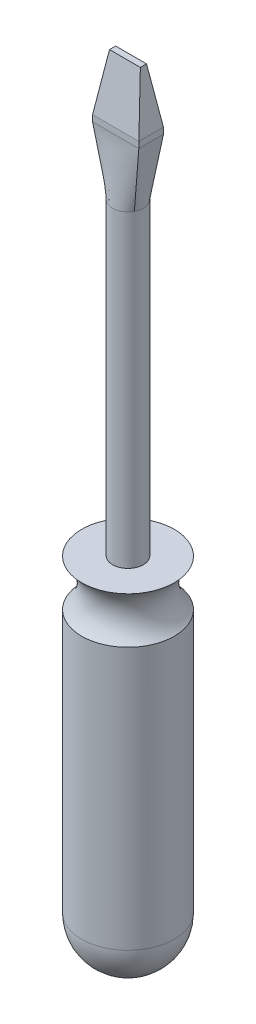
ISO-10303-21;
HEADER;
FILE_DESCRIPTION(('STEP AP214'),'2;1');
FILE_NAME('part.step','',(''),(''),'','','');
FILE_SCHEMA(('AUTOMOTIVE_DESIGN { 1 0 10303 214 1 1 1 1 }'));
ENDSEC;
DATA;
#1=APPLICATION_CONTEXT('core data for automotive mechanical design processes');
#2=APPLICATION_PROTOCOL_DEFINITION('international standard','automotive_design',2000,#1);
#3=PRODUCT_CONTEXT('',#1,'mechanical');
#4=PRODUCT('Part','Part','',(#3));
#5=PRODUCT_RELATED_PRODUCT_CATEGORY('part','',(#4));
#6=PRODUCT_DEFINITION_FORMATION('','',#4);
#7=PRODUCT_DEFINITION_CONTEXT('part definition',#1,'design');
#8=PRODUCT_DEFINITION('design','',#6,#7);
#9=PRODUCT_DEFINITION_SHAPE('','',#8);
#10=(LENGTH_UNIT() NAMED_UNIT(*) SI_UNIT(.MILLI.,.METRE.));
#11=(NAMED_UNIT(*) PLANE_ANGLE_UNIT() SI_UNIT($,.RADIAN.));
#12=(NAMED_UNIT(*) SI_UNIT($,.STERADIAN.) SOLID_ANGLE_UNIT());
#13=UNCERTAINTY_MEASURE_WITH_UNIT(LENGTH_MEASURE(1.E-05),#10,'distance_accuracy_value','');
#14=(GEOMETRIC_REPRESENTATION_CONTEXT(3) GLOBAL_UNCERTAINTY_ASSIGNED_CONTEXT((#13)) GLOBAL_UNIT_ASSIGNED_CONTEXT((#10,
#11,#12)) REPRESENTATION_CONTEXT('',''));
#15=CARTESIAN_POINT('',(0.,0.,0.));
#16=DIRECTION('',(0.,0.,1.));
#17=DIRECTION('',(1.,0.,0.));
#18=AXIS2_PLACEMENT_3D('',#15,#16,#17);
#19=CARTESIAN_POINT('',(0.,8.33,0.));
#20=DIRECTION('',(0.,-1.,0.));
#21=DIRECTION('',(0.,0.,-1.));
#22=AXIS2_PLACEMENT_3D('',#19,#20,#21);
#23=CYLINDRICAL_SURFACE('',#22,0.25);
#24=CARTESIAN_POINT('',(0.220584767675422,8.32999999937951,0.117653560377832));
#25=CARTESIAN_POINT('',(0.223895503250794,8.33000760524374,0.111447662226681));
#26=CARTESIAN_POINT('',(0.226942525622998,8.330106840505,0.105102891851778));
#27=CARTESIAN_POINT('',(0.232491387490373,8.33035427569991,0.0921798481124795));
#28=CARTESIAN_POINT('',(0.234993215228491,8.33050247668932,0.0856015697160707));
#29=CARTESIAN_POINT('',(0.239430949186873,8.33071340242395,0.0722645516503332));
#30=CARTESIAN_POINT('',(0.241367574651988,8.33077623617844,0.0655060533840937));
#31=CARTESIAN_POINT('',(0.244664857885471,8.33076876888091,0.0518501331683878));
#32=CARTESIAN_POINT('',(0.246025528224331,8.33069847073475,0.0449527142543722));
#33=CARTESIAN_POINT('',(0.248162373998193,8.33046613436582,0.0310625301912614));
#34=CARTESIAN_POINT('',(0.248937931759474,8.33030399951081,0.0240696721953106));
#35=CARTESIAN_POINT('',(0.249897096671828,8.33006059794133,0.0100421207075355));
#36=CARTESIAN_POINT('',(0.250080782759349,8.32997932044412,0.0030074329198293));
#37=CARTESIAN_POINT('',(0.249854529071589,8.33004594723594,-0.0110500691070349));
#38=CARTESIAN_POINT('',(0.249444710494667,8.33019380473423,-0.0180728854772538));
#39=CARTESIAN_POINT('',(0.248035943141497,8.33048086415504,-0.0320569386292218));
#40=CARTESIAN_POINT('',(0.247036974397994,8.33062006578403,-0.0390181733157511));
#41=CARTESIAN_POINT('',(0.243409065531116,8.33082838683894,-0.0584216292134271));
#42=CARTESIAN_POINT('',(0.240115307959746,8.33075015870858,-0.0707508476074166));
#43=CARTESIAN_POINT('',(0.233804582622328,8.33044046915203,-0.0887475720229695));
#44=CARTESIAN_POINT('',(0.231470415901914,8.33030500919291,-0.0946678406394103));
#45=CARTESIAN_POINT('',(0.226357545092206,8.33008527072871,-0.106313646433992));
#46=CARTESIAN_POINT('',(0.223578865252806,8.33000098943283,-0.11203919421425));
#47=CARTESIAN_POINT('',(0.220584037163021,8.32999999909056,-0.117654929981124));
#48=B_SPLINE_CURVE_WITH_KNOTS('',3,(#24,#25,#26,#27,#28,#29,#30,#31,#32,#33,#34,#35,#36,#37,#38,
#39,#40,#41,#42,#43,#44,#45,#46,#47),.UNSPECIFIED.,.F.,.F.,(4,2,2,2,2,2,2,2,2,2,2,4),(0.,
0.0210928949861277,0.0421862447928407,0.063252634156513,0.0843185637126489,0.105406700506582,
0.126492024711936,0.147573043734018,0.168654777267132,0.206759216014801,0.225839793234812,
0.24491932989102),.UNSPECIFIED.);
#49=CARTESIAN_POINT('',(0.22089985520379,8.33,0.117821618988406));
#50=VERTEX_POINT('',#49);
#51=CARTESIAN_POINT('',(0.220873348394953,8.33,-0.117809242565207));
#52=VERTEX_POINT('',#51);
#53=EDGE_CURVE('E13',#50,#52,#48,.T.);
#54=ORIENTED_EDGE('',*,*,#53,.F.);
#55=CARTESIAN_POINT('',(0.,8.33,0.));
#56=DIRECTION('',(0.,1.,0.));
#57=DIRECTION('',(0.,0.,1.));
#58=AXIS2_PLACEMENT_3D('',#55,#56,#57);
#59=CIRCLE('',#58,0.25);
#60=CARTESIAN_POINT('',(-0.220873348394953,8.33,0.117809242565207));
#61=VERTEX_POINT('',#60);
#62=EDGE_CURVE('E110',#61,#50,#59,.T.);
#63=ORIENTED_EDGE('',*,*,#62,.F.);
#64=CARTESIAN_POINT('',(-0.220584767675422,8.32999999937951,-0.117653560377832));
#65=CARTESIAN_POINT('',(-0.223895503250794,8.33000760524374,-0.111447662226681));
#66=CARTESIAN_POINT('',(-0.226942525622998,8.330106840505,-0.105102891851778));
#67=CARTESIAN_POINT('',(-0.232491387490373,8.33035427569991,-0.0921798481124798));
#68=CARTESIAN_POINT('',(-0.234993215228491,8.33050247668932,-0.085601569716071));
#69=CARTESIAN_POINT('',(-0.239430949186873,8.33071340242395,-0.0722645516503335));
#70=CARTESIAN_POINT('',(-0.241367574651988,8.33077623617843,-0.065506053384094));
#71=CARTESIAN_POINT('',(-0.244664857885471,8.33076876888091,-0.0518501331683881));
#72=CARTESIAN_POINT('',(-0.24602552822433,8.33069847073475,-0.0449527142543724));
#73=CARTESIAN_POINT('',(-0.248162373998193,8.33046613436582,-0.0310625301912616));
#74=CARTESIAN_POINT('',(-0.248937931759474,8.33030399951081,-0.0240696721953109));
#75=CARTESIAN_POINT('',(-0.249897096671828,8.33006059794133,-0.0100421207075359));
#76=CARTESIAN_POINT('',(-0.250080782759349,8.32997932044412,-0.00300743291982959));
#77=CARTESIAN_POINT('',(-0.249854529071589,8.33004594723594,0.0110500691070346));
#78=CARTESIAN_POINT('',(-0.249444710494667,8.33019380473423,0.0180728854772535));
#79=CARTESIAN_POINT('',(-0.248035943141497,8.33048086415504,0.0320569386292215));
#80=CARTESIAN_POINT('',(-0.247036974397994,8.33062006578403,0.0390181733157507));
#81=CARTESIAN_POINT('',(-0.243409065531116,8.33082838683893,0.0584216292134269));
#82=CARTESIAN_POINT('',(-0.240115307959746,8.33075015870857,0.0707508476074164));
#83=CARTESIAN_POINT('',(-0.233804582622328,8.33044046915203,0.0887475720229693));
#84=CARTESIAN_POINT('',(-0.231470415901914,8.33030500919291,0.0946678406394101));
#85=CARTESIAN_POINT('',(-0.226357545092206,8.33008527072871,0.106313646433991));
#86=CARTESIAN_POINT('',(-0.223578865252806,8.33000098943284,0.11203919421425));
#87=CARTESIAN_POINT('',(-0.220584037163021,8.32999999909056,0.117654929981124));
#88=B_SPLINE_CURVE_WITH_KNOTS('',3,(#64,#65,#66,#67,#68,#69,#70,#71,#72,#73,#74,#75,#76,#77,#78,
#79,#80,#81,#82,#83,#84,#85,#86,#87),.UNSPECIFIED.,.F.,.F.,(4,2,2,2,2,2,2,2,2,2,2,4),(0.,
0.0210928949861277,0.0421862447928407,0.063252634156513,0.0843185637126489,0.105406700506582,
0.126492024711936,0.147573043734018,0.168654777267132,0.206759216014802,0.225839793234812,
0.24491932989102),.UNSPECIFIED.);
#89=CARTESIAN_POINT('',(-0.220899855203791,8.33,-0.117821618988406));
#90=VERTEX_POINT('',#89);
#91=EDGE_CURVE('E158',#90,#61,#88,.T.);
#92=ORIENTED_EDGE('',*,*,#91,.F.);
#93=EDGE_CURVE('E155',#52,#90,#59,.T.);
#94=ORIENTED_EDGE('',*,*,#93,.F.);
#95=EDGE_LOOP('',(#54,#63,#92,#94));
#96=FACE_BOUND('',#95,.T.);
#97=CARTESIAN_POINT('',(0.,3.33,0.));
#98=DIRECTION('',(0.,1.,0.));
#99=DIRECTION('',(0.,0.,1.));
#100=AXIS2_PLACEMENT_3D('',#97,#98,#99);
#101=CIRCLE('',#100,0.25);
#102=CARTESIAN_POINT('',(0.,3.33,0.25));
#103=VERTEX_POINT('',#102);
#104=EDGE_CURVE('E101',#103,#103,#101,.T.);
#105=ORIENTED_EDGE('',*,*,#104,.T.);
#106=EDGE_LOOP('',(#105));
#107=FACE_BOUND('',#106,.T.);
#108=ADVANCED_FACE('F91',(#96,#107),#23,.T.);
#109=CARTESIAN_POINT('',(0.,3.33,0.));
#110=DIRECTION('',(0.,1.,0.));
#111=DIRECTION('',(0.,0.,1.));
#112=AXIS2_PLACEMENT_3D('',#109,#110,#111);
#113=PLANE('',#112);
#114=ORIENTED_EDGE('',*,*,#104,.F.);
#115=EDGE_LOOP('',(#114));
#116=FACE_BOUND('',#115,.T.);
#117=ADVANCED_FACE('F209',(#116),#113,.F.);
#118=CARTESIAN_POINT('',(-0.220588235294118,8.33,0.117647058823529));
#119=CARTESIAN_POINT('',(-0.375,9.33,0.2));
#120=CARTESIAN_POINT('',(-0.203287197231834,8.33,0.150086505190311));
#121=CARTESIAN_POINT('',(-0.312499999999999,9.33,0.2));
#122=CARTESIAN_POINT('',(-0.175911118592711,8.33,0.183465196532278));
#123=CARTESIAN_POINT('',(-0.249999999999999,9.33,0.2));
#124=CARTESIAN_POINT('',(-0.0993182392054541,8.33,0.233965996128272));
#125=CARTESIAN_POINT('',(-0.124999999999998,9.33,0.2));
#126=CARTESIAN_POINT('',(-0.05,8.33,0.25));
#127=CARTESIAN_POINT('',(-0.0624999999999981,9.33,0.2));
#128=CARTESIAN_POINT('',(0.0499999999999999,8.33,0.25));
#129=CARTESIAN_POINT('',(0.0625000000000019,9.33,0.2));
#130=CARTESIAN_POINT('',(0.099318239205454,8.33,0.233965996128272));
#131=CARTESIAN_POINT('',(0.125000000000002,9.33,0.2));
#132=CARTESIAN_POINT('',(0.175911118592711,8.33,0.183465196532278));
#133=CARTESIAN_POINT('',(0.250000000000001,9.33,0.2));
#134=CARTESIAN_POINT('',(0.203287197231834,8.33,0.150086505190311));
#135=CARTESIAN_POINT('',(0.312500000000001,9.33,0.2));
#136=CARTESIAN_POINT('',(0.220588235294118,8.33,0.117647058823529));
#137=CARTESIAN_POINT('',(0.375,9.33,0.2));
#138=B_SPLINE_SURFACE_WITH_KNOTS('',3,1,((#118,#119),(#120,#121),(#122,#123),(#124,#125),(#126,
#127),(#128,#129),(#130,#131),(#132,#133),(#134,#135),(#136,#137)),.UNSPECIFIED.,.F.,.F.,.F.,(4,
2,2,2,4),(2,2),(0.,0.25,0.5,0.75,1.),(0.,1.),.UNSPECIFIED.);
#139=DIRECTION('',(0.152100292722572,0.985030467155704,0.0811201561187051));
#140=VECTOR('',#139,1.);
#141=CARTESIAN_POINT('',(0.297794117647059,8.83,0.158823529411765));
#142=LINE('',#141,#140);
#143=CARTESIAN_POINT('',(0.375,9.33,0.199637890792641));
#144=VERTEX_POINT('',#143);
#145=EDGE_CURVE('E138',#50,#144,#142,.T.);
#146=DIRECTION('',(1.,0.,0.));
#147=VECTOR('',#146,1.);
#148=CARTESIAN_POINT('',(-0.375,9.33,0.2));
#149=LINE('',#148,#147);
#150=CARTESIAN_POINT('',(-0.375,9.33,0.199637890792641));
#151=VERTEX_POINT('',#150);
#152=EDGE_CURVE('E298',#151,#144,#149,.T.);
#153=DIRECTION('',(0.152100292722572,-0.985030467155704,-0.0811201561187051));
#154=VECTOR('',#153,1.);
#155=CARTESIAN_POINT('',(-0.297794117647059,8.83,0.158823529411765));
#156=LINE('',#155,#154);
#157=EDGE_CURVE('E164',#151,#61,#156,.T.);
#158=ORIENTED_EDGE('',*,*,#62,.T.);
#159=ORIENTED_EDGE('',*,*,#145,.T.);
#160=ORIENTED_EDGE('',*,*,#152,.F.);
#161=ORIENTED_EDGE('',*,*,#157,.T.);
#162=EDGE_LOOP('',(#158,#159,#160,#161));
#163=FACE_BOUND('',#162,.T.);
#164=ADVANCED_FACE('F217',(#163),#138,.T.);
#165=CARTESIAN_POINT('',(0.219480968858131,8.33,0.119723183391003));
#166=CARTESIAN_POINT('',(0.375,9.33,0.204));
#167=CARTESIAN_POINT('',(0.219850057670127,8.33,0.119031141868512));
#168=CARTESIAN_POINT('',(0.375,9.33,0.202666666666667));
#169=CARTESIAN_POINT('',(0.220219146482122,8.33,0.118339100346021));
#170=CARTESIAN_POINT('',(0.375,9.33,0.201333333333333));
#171=CARTESIAN_POINT('',(0.220588235294118,8.33,0.117647058823529));
#172=CARTESIAN_POINT('',(0.375,9.33,0.2));
#173=CARTESIAN_POINT('',(0.239042675893887,8.33,0.0830449826989619));
#174=CARTESIAN_POINT('',(0.375,9.33,0.133333333333333));
#175=CARTESIAN_POINT('',(0.25,8.33,0.0416666666666667));
#176=CARTESIAN_POINT('',(0.375,9.33,0.0666666666666667));
#177=CARTESIAN_POINT('',(0.25,8.33,-0.0416666666666667));
#178=CARTESIAN_POINT('',(0.375,9.33,-0.0666666666666666));
#179=CARTESIAN_POINT('',(0.239042675893887,8.33,-0.083044982698962));
#180=CARTESIAN_POINT('',(0.375,9.33,-0.133333333333333));
#181=CARTESIAN_POINT('',(0.220588235294118,8.33,-0.117647058823529));
#182=CARTESIAN_POINT('',(0.375,9.33,-0.2));
#183=CARTESIAN_POINT('',(0.220219146482122,8.33,-0.118339100346021));
#184=CARTESIAN_POINT('',(0.375,9.33,-0.201333333333333));
#185=CARTESIAN_POINT('',(0.219850057670127,8.33,-0.119031141868512));
#186=CARTESIAN_POINT('',(0.375,9.33,-0.202666666666667));
#187=CARTESIAN_POINT('',(0.219480968858131,8.33,-0.119723183391004));
#188=CARTESIAN_POINT('',(0.375,9.33,-0.204));
#189=B_SPLINE_SURFACE_WITH_KNOTS('',3,1,((#165,#166),(#167,#168),(#169,#170),(#171,#172),(#173,
#174),(#175,#176),(#177,#178),(#179,#180),(#181,#182),(#183,#184),(#185,#186),(#187,#188)),
.UNSPECIFIED.,.F.,.F.,.F.,(4,3,2,3,4),(2,2),(-0.01,0.,0.5,1.,1.01),(0.,1.),.UNSPECIFIED.);
#190=DIRECTION('',(0.152100292722572,0.985030467155704,-0.0811201561187051));
#191=VECTOR('',#190,1.);
#192=CARTESIAN_POINT('',(0.297794117647059,8.83,-0.158823529411765));
#193=LINE('',#192,#191);
#194=CARTESIAN_POINT('',(0.375,9.33,-0.199637890792641));
#195=VERTEX_POINT('',#194);
#196=EDGE_CURVE('E169',#52,#195,#193,.T.);
#197=DIRECTION('',(0.,0.,-1.));
#198=VECTOR('',#197,1.);
#199=CARTESIAN_POINT('',(0.375,9.33,-0.2));
#200=LINE('',#199,#198);
#201=EDGE_CURVE('E177',#144,#195,#200,.T.);
#202=ORIENTED_EDGE('',*,*,#53,.T.);
#203=ORIENTED_EDGE('',*,*,#196,.T.);
#204=ORIENTED_EDGE('',*,*,#201,.F.);
#205=ORIENTED_EDGE('',*,*,#145,.F.);
#206=EDGE_LOOP('',(#202,#203,#204,#205));
#207=FACE_BOUND('',#206,.T.);
#208=ADVANCED_FACE('F168',(#207),#189,.T.);
#209=CARTESIAN_POINT('',(-0.219480968858131,8.33,-0.119723183391004));
#210=CARTESIAN_POINT('',(-0.375,9.33,-0.204));
#211=CARTESIAN_POINT('',(-0.219850057670127,8.33,-0.119031141868512));
#212=CARTESIAN_POINT('',(-0.375,9.33,-0.202666666666667));
#213=CARTESIAN_POINT('',(-0.220219146482122,8.33,-0.118339100346021));
#214=CARTESIAN_POINT('',(-0.375,9.33,-0.201333333333333));
#215=CARTESIAN_POINT('',(-0.220588235294118,8.33,-0.117647058823529));
#216=CARTESIAN_POINT('',(-0.375,9.33,-0.2));
#217=CARTESIAN_POINT('',(-0.239042675893887,8.33,-0.083044982698962));
#218=CARTESIAN_POINT('',(-0.375,9.33,-0.133333333333333));
#219=CARTESIAN_POINT('',(-0.25,8.33,-0.0416666666666667));
#220=CARTESIAN_POINT('',(-0.375,9.33,-0.0666666666666667));
#221=CARTESIAN_POINT('',(-0.25,8.33,0.0416666666666666));
#222=CARTESIAN_POINT('',(-0.375,9.33,0.0666666666666666));
#223=CARTESIAN_POINT('',(-0.239042675893887,8.33,0.0830449826989619));
#224=CARTESIAN_POINT('',(-0.375,9.33,0.133333333333333));
#225=CARTESIAN_POINT('',(-0.220588235294118,8.33,0.117647058823529));
#226=CARTESIAN_POINT('',(-0.375,9.33,0.2));
#227=CARTESIAN_POINT('',(-0.220219146482122,8.33,0.118339100346021));
#228=CARTESIAN_POINT('',(-0.375,9.33,0.201333333333333));
#229=CARTESIAN_POINT('',(-0.219850057670127,8.33,0.119031141868512));
#230=CARTESIAN_POINT('',(-0.375,9.33,0.202666666666667));
#231=CARTESIAN_POINT('',(-0.219480968858131,8.33,0.119723183391003));
#232=CARTESIAN_POINT('',(-0.375,9.33,0.204));
#233=B_SPLINE_SURFACE_WITH_KNOTS('',3,1,((#209,#210),(#211,#212),(#213,#214),(#215,#216),(#217,
#218),(#219,#220),(#221,#222),(#223,#224),(#225,#226),(#227,#228),(#229,#230),(#231,#232)),
.UNSPECIFIED.,.F.,.F.,.F.,(4,3,2,3,4),(2,2),(-0.01,0.,0.5,1.,1.01),(0.,1.),.UNSPECIFIED.);
#234=DIRECTION('',(0.,0.,1.));
#235=VECTOR('',#234,1.);
#236=CARTESIAN_POINT('',(-0.375,9.33,-0.2));
#237=LINE('',#236,#235);
#238=CARTESIAN_POINT('',(-0.375,9.33,-0.199637890792641));
#239=VERTEX_POINT('',#238);
#240=EDGE_CURVE('E227',#239,#151,#237,.T.);
#241=DIRECTION('',(-0.152100292722572,0.985030467155704,-0.0811201561187051));
#242=VECTOR('',#241,1.);
#243=CARTESIAN_POINT('',(-0.297794117647059,8.83,-0.158823529411765));
#244=LINE('',#243,#242);
#245=EDGE_CURVE('E175',#90,#239,#244,.T.);
#246=ORIENTED_EDGE('',*,*,#91,.T.);
#247=ORIENTED_EDGE('',*,*,#157,.F.);
#248=ORIENTED_EDGE('',*,*,#240,.F.);
#249=ORIENTED_EDGE('',*,*,#245,.F.);
#250=EDGE_LOOP('',(#246,#247,#248,#249));
#251=FACE_BOUND('',#250,.T.);
#252=ADVANCED_FACE('F204',(#251),#233,.T.);
#253=CARTESIAN_POINT('',(0.220588235294118,8.33,-0.117647058823529));
#254=CARTESIAN_POINT('',(0.375,9.33,-0.2));
#255=CARTESIAN_POINT('',(0.203287197231834,8.33,-0.150086505190311));
#256=CARTESIAN_POINT('',(0.312499999999999,9.33,-0.2));
#257=CARTESIAN_POINT('',(0.175911118592711,8.33,-0.183465196532278));
#258=CARTESIAN_POINT('',(0.249999999999999,9.33,-0.2));
#259=CARTESIAN_POINT('',(0.0993182392054541,8.33,-0.233965996128272));
#260=CARTESIAN_POINT('',(0.124999999999998,9.33,-0.2));
#261=CARTESIAN_POINT('',(0.05,8.33,-0.25));
#262=CARTESIAN_POINT('',(0.0624999999999982,9.33,-0.2));
#263=CARTESIAN_POINT('',(-0.0499999999999999,8.33,-0.25));
#264=CARTESIAN_POINT('',(-0.0625000000000018,9.33,-0.2));
#265=CARTESIAN_POINT('',(-0.099318239205454,8.33,-0.233965996128272));
#266=CARTESIAN_POINT('',(-0.125000000000002,9.33,-0.2));
#267=CARTESIAN_POINT('',(-0.175911118592711,8.33,-0.183465196532278));
#268=CARTESIAN_POINT('',(-0.250000000000001,9.33,-0.2));
#269=CARTESIAN_POINT('',(-0.203287197231834,8.33,-0.150086505190312));
#270=CARTESIAN_POINT('',(-0.312500000000001,9.33,-0.2));
#271=CARTESIAN_POINT('',(-0.220588235294118,8.33,-0.117647058823529));
#272=CARTESIAN_POINT('',(-0.375,9.33,-0.2));
#273=B_SPLINE_SURFACE_WITH_KNOTS('',3,1,((#253,#254),(#255,#256),(#257,#258),(#259,#260),(#261,
#262),(#263,#264),(#265,#266),(#267,#268),(#269,#270),(#271,#272)),.UNSPECIFIED.,.F.,.F.,.F.,(4,
2,2,2,4),(2,2),(0.,0.25,0.5,0.75,1.),(0.,1.),.UNSPECIFIED.);
#274=DIRECTION('',(-1.,0.,0.));
#275=VECTOR('',#274,1.);
#276=CARTESIAN_POINT('',(-0.375,9.33,-0.2));
#277=LINE('',#276,#275);
#278=EDGE_CURVE('E173',#195,#239,#277,.T.);
#279=ORIENTED_EDGE('',*,*,#93,.T.);
#280=ORIENTED_EDGE('',*,*,#245,.T.);
#281=ORIENTED_EDGE('',*,*,#278,.F.);
#282=ORIENTED_EDGE('',*,*,#196,.F.);
#283=EDGE_LOOP('',(#279,#280,#281,#282));
#284=FACE_BOUND('',#283,.T.);
#285=ADVANCED_FACE('F171',(#284),#273,.T.);
#286=CARTESIAN_POINT('',(0.375,9.43,-0.199275781585282));
#287=DIRECTION('',(-1.,0.,0.));
#288=DIRECTION('',(0.,0.,1.));
#289=AXIS2_PLACEMENT_3D('',#286,#287,#288);
#290=PLANE('',#289);
#291=ORIENTED_EDGE('',*,*,#201,.T.);
#292=DIRECTION('',(0.,-1.,0.));
#293=VECTOR('',#292,1.);
#294=CARTESIAN_POINT('',(0.375,9.43,-0.199275781585282));
#295=LINE('',#294,#293);
#296=CARTESIAN_POINT('',(0.375,9.43,-0.199275781585282));
#297=VERTEX_POINT('',#296);
#298=EDGE_CURVE('E242',#297,#195,#295,.T.);
#299=ORIENTED_EDGE('',*,*,#298,.F.);
#300=DIRECTION('',(0.,0.,1.));
#301=VECTOR('',#300,1.);
#302=CARTESIAN_POINT('',(0.375,9.43,0.));
#303=LINE('',#302,#301);
#304=CARTESIAN_POINT('',(0.375,9.43,0.199275781585282));
#305=VERTEX_POINT('',#304);
#306=EDGE_CURVE('E312',#305,#297,#303,.F.);
#307=ORIENTED_EDGE('',*,*,#306,.F.);
#308=DIRECTION('',(0.,-1.,0.));
#309=VECTOR('',#308,1.);
#310=CARTESIAN_POINT('',(0.375,9.43,0.199275781585282));
#311=LINE('',#310,#309);
#312=EDGE_CURVE('E248',#305,#144,#311,.T.);
#313=ORIENTED_EDGE('',*,*,#312,.T.);
#314=EDGE_LOOP('',(#291,#299,#307,#313));
#315=FACE_BOUND('',#314,.T.);
#316=ADVANCED_FACE('F203',(#315),#290,.F.);
#317=CARTESIAN_POINT('',(-0.375,9.43,-0.199275781585282));
#318=DIRECTION('',(0.,0.,1.));
#319=DIRECTION('',(1.,0.,0.));
#320=AXIS2_PLACEMENT_3D('',#317,#318,#319);
#321=PLANE('',#320);
#322=ORIENTED_EDGE('',*,*,#278,.T.);
#323=DIRECTION('',(0.,-1.,0.));
#324=VECTOR('',#323,1.);
#325=CARTESIAN_POINT('',(-0.375,9.43,-0.199275781585282));
#326=LINE('',#325,#324);
#327=CARTESIAN_POINT('',(-0.375,9.43,-0.199275781585282));
#328=VERTEX_POINT('',#327);
#329=EDGE_CURVE('E257',#328,#239,#326,.T.);
#330=ORIENTED_EDGE('',*,*,#329,.F.);
#331=DIRECTION('',(1.,0.,0.));
#332=VECTOR('',#331,1.);
#333=CARTESIAN_POINT('',(0.,9.43000000000001,-0.199275781585282));
#334=LINE('',#333,#332);
#335=EDGE_CURVE('E95',#297,#328,#334,.F.);
#336=ORIENTED_EDGE('',*,*,#335,.F.);
#337=ORIENTED_EDGE('',*,*,#298,.T.);
#338=EDGE_LOOP('',(#322,#330,#336,#337));
#339=FACE_BOUND('',#338,.T.);
#340=ADVANCED_FACE('F282',(#339),#321,.F.);
#341=CARTESIAN_POINT('',(-0.375,9.43,-0.199275781585282));
#342=DIRECTION('',(1.,0.,0.));
#343=DIRECTION('',(0.,0.,-1.));
#344=AXIS2_PLACEMENT_3D('',#341,#342,#343);
#345=PLANE('',#344);
#346=ORIENTED_EDGE('',*,*,#240,.T.);
#347=DIRECTION('',(0.,-1.,0.));
#348=VECTOR('',#347,1.);
#349=CARTESIAN_POINT('',(-0.375,9.43,0.199275781585282));
#350=LINE('',#349,#348);
#351=CARTESIAN_POINT('',(-0.375,9.43,0.199275781585282));
#352=VERTEX_POINT('',#351);
#353=EDGE_CURVE('E251',#352,#151,#350,.T.);
#354=ORIENTED_EDGE('',*,*,#353,.F.);
#355=DIRECTION('',(0.,0.,1.));
#356=VECTOR('',#355,1.);
#357=CARTESIAN_POINT('',(-0.375,9.43,0.));
#358=LINE('',#357,#356);
#359=EDGE_CURVE('E317',#328,#352,#358,.T.);
#360=ORIENTED_EDGE('',*,*,#359,.F.);
#361=ORIENTED_EDGE('',*,*,#329,.T.);
#362=EDGE_LOOP('',(#346,#354,#360,#361));
#363=FACE_BOUND('',#362,.T.);
#364=ADVANCED_FACE('F275',(#363),#345,.F.);
#365=CARTESIAN_POINT('',(-0.375,9.43,0.199275781585282));
#366=DIRECTION('',(0.,0.,-1.));
#367=DIRECTION('',(-1.,0.,0.));
#368=AXIS2_PLACEMENT_3D('',#365,#366,#367);
#369=PLANE('',#368);
#370=ORIENTED_EDGE('',*,*,#152,.T.);
#371=ORIENTED_EDGE('',*,*,#312,.F.);
#372=DIRECTION('',(1.,0.,0.));
#373=VECTOR('',#372,1.);
#374=CARTESIAN_POINT('',(0.,9.43000000000001,0.199275781585282));
#375=LINE('',#374,#373);
#376=EDGE_CURVE('E252',#352,#305,#375,.T.);
#377=ORIENTED_EDGE('',*,*,#376,.F.);
#378=ORIENTED_EDGE('',*,*,#353,.T.);
#379=EDGE_LOOP('',(#370,#371,#377,#378));
#380=FACE_BOUND('',#379,.T.);
#381=ADVANCED_FACE('F264',(#380),#369,.F.);
#382=CARTESIAN_POINT('',(0.,10.33,0.));
#383=DIRECTION('',(0.,1.,0.));
#384=DIRECTION('',(0.,0.,1.));
#385=AXIS2_PLACEMENT_3D('',#382,#383,#384);
#386=PLANE('',#385);
#387=DIRECTION('',(0.,0.,-1.));
#388=VECTOR('',#387,1.);
#389=CARTESIAN_POINT('',(0.25,10.33,-0.05));
#390=LINE('',#389,#388);
#391=CARTESIAN_POINT('',(0.25,10.33,0.05));
#392=VERTEX_POINT('',#391);
#393=CARTESIAN_POINT('',(0.25,10.33,-0.05));
#394=VERTEX_POINT('',#393);
#395=EDGE_CURVE('E339',#392,#394,#390,.T.);
#396=ORIENTED_EDGE('',*,*,#395,.T.);
#397=DIRECTION('',(-1.,0.,0.));
#398=VECTOR('',#397,1.);
#399=CARTESIAN_POINT('',(-0.25,10.33,-0.05));
#400=LINE('',#399,#398);
#401=CARTESIAN_POINT('',(-0.25,10.33,-0.05));
#402=VERTEX_POINT('',#401);
#403=EDGE_CURVE('E315',#394,#402,#400,.T.);
#404=ORIENTED_EDGE('',*,*,#403,.T.);
#405=DIRECTION('',(0.,0.,1.));
#406=VECTOR('',#405,1.);
#407=CARTESIAN_POINT('',(-0.25,10.33,-0.05));
#408=LINE('',#407,#406);
#409=CARTESIAN_POINT('',(-0.25,10.33,0.05));
#410=VERTEX_POINT('',#409);
#411=EDGE_CURVE('E334',#402,#410,#408,.T.);
#412=ORIENTED_EDGE('',*,*,#411,.T.);
#413=DIRECTION('',(1.,0.,0.));
#414=VECTOR('',#413,1.);
#415=CARTESIAN_POINT('',(-0.25,10.33,0.05));
#416=LINE('',#415,#414);
#417=EDGE_CURVE('E381',#410,#392,#416,.T.);
#418=ORIENTED_EDGE('',*,*,#417,.T.);
#419=EDGE_LOOP('',(#396,#404,#412,#418));
#420=FACE_BOUND('',#419,.T.);
#421=ADVANCED_FACE('F274',(#420),#386,.T.);
#422=CARTESIAN_POINT('',(1.65283875851628,0.229560938682816,0.));
#423=DIRECTION('',(-0.990492273177752,-0.137568371274688,0.));
#424=DIRECTION('',(0.137568371274688,-0.990492273177752,0.));
#425=AXIS2_PLACEMENT_3D('',#422,#423,#424);
#426=PLANE('',#425);
#427=DIRECTION('',(-0.135748669059126,0.977390417225709,0.162111909383703));
#428=VECTOR('',#427,1.);
#429=CARTESIAN_POINT('',(0.375,9.43,-0.199275781585282));
#430=LINE('',#429,#428);
#431=EDGE_CURVE('E330',#297,#394,#430,.T.);
#432=ORIENTED_EDGE('',*,*,#431,.T.);
#433=ORIENTED_EDGE('',*,*,#395,.F.);
#434=DIRECTION('',(-0.135748669059126,0.977390417225709,-0.162111909383703));
#435=VECTOR('',#434,1.);
#436=CARTESIAN_POINT('',(0.375,9.43,0.199275781585282));
#437=LINE('',#436,#435);
#438=EDGE_CURVE('E337',#305,#392,#437,.T.);
#439=ORIENTED_EDGE('',*,*,#438,.F.);
#440=ORIENTED_EDGE('',*,*,#306,.T.);
#441=EDGE_LOOP('',(#432,#433,#439,#440));
#442=FACE_BOUND('',#441,.T.);
#443=ADVANCED_FACE('F400',(#442),#426,.F.);
#444=CARTESIAN_POINT('',(0.,0.284642845758419,1.7161428227808));
#445=DIRECTION('',(0.,-0.163626550251267,-0.986522352535851));
#446=DIRECTION('',(0.,0.986522352535851,-0.163626550251267));
#447=AXIS2_PLACEMENT_3D('',#444,#445,#446);
#448=PLANE('',#447);
#449=ORIENTED_EDGE('',*,*,#438,.T.);
#450=ORIENTED_EDGE('',*,*,#417,.F.);
#451=DIRECTION('',(0.135748669059126,0.977390417225709,-0.162111909383703));
#452=VECTOR('',#451,1.);
#453=CARTESIAN_POINT('',(-0.375,9.43,0.199275781585282));
#454=LINE('',#453,#452);
#455=EDGE_CURVE('E336',#352,#410,#454,.T.);
#456=ORIENTED_EDGE('',*,*,#455,.F.);
#457=ORIENTED_EDGE('',*,*,#376,.T.);
#458=EDGE_LOOP('',(#449,#450,#456,#457));
#459=FACE_BOUND('',#458,.T.);
#460=ADVANCED_FACE('F364',(#459),#448,.F.);
#461=CARTESIAN_POINT('',(0.,0.284642845758419,-1.7161428227808));
#462=DIRECTION('',(0.,-0.163626550251267,0.986522352535851));
#463=DIRECTION('',(0.,-0.986522352535851,-0.163626550251267));
#464=AXIS2_PLACEMENT_3D('',#461,#462,#463);
#465=PLANE('',#464);
#466=DIRECTION('',(0.135748669059126,0.977390417225709,0.162111909383703));
#467=VECTOR('',#466,1.);
#468=CARTESIAN_POINT('',(-0.375,9.43,-0.199275781585282));
#469=LINE('',#468,#467);
#470=EDGE_CURVE('E329',#328,#402,#469,.T.);
#471=ORIENTED_EDGE('',*,*,#470,.T.);
#472=ORIENTED_EDGE('',*,*,#403,.F.);
#473=ORIENTED_EDGE('',*,*,#431,.F.);
#474=ORIENTED_EDGE('',*,*,#335,.T.);
#475=EDGE_LOOP('',(#471,#472,#473,#474));
#476=FACE_BOUND('',#475,.T.);
#477=ADVANCED_FACE('F327',(#476),#465,.F.);
#478=CARTESIAN_POINT('',(-1.65283875851628,0.229560938682816,0.));
#479=DIRECTION('',(0.990492273177752,-0.137568371274688,0.));
#480=DIRECTION('',(0.137568371274688,0.990492273177752,0.));
#481=AXIS2_PLACEMENT_3D('',#478,#479,#480);
#482=PLANE('',#481);
#483=ORIENTED_EDGE('',*,*,#455,.T.);
#484=ORIENTED_EDGE('',*,*,#411,.F.);
#485=ORIENTED_EDGE('',*,*,#470,.F.);
#486=ORIENTED_EDGE('',*,*,#359,.T.);
#487=EDGE_LOOP('',(#483,#484,#485,#486));
#488=FACE_BOUND('',#487,.T.);
#489=ADVANCED_FACE('F332',(#488),#482,.F.);
#490=CLOSED_SHELL('',(#108,#117,#164,#208,#252,#285,#316,#340,#364,#381,#421,#443,#460,#477,#489));
#491=MANIFOLD_SOLID_BREP('B2',#490);
#492=CARTESIAN_POINT('',(0.,2.57703162179985,0.));
#493=DIRECTION('',(0.,-1.,0.));
#494=DIRECTION('',(0.,0.,-1.));
#495=AXIS2_PLACEMENT_3D('',#492,#493,#494);
#496=CYLINDRICAL_SURFACE('',#495,0.75);
#497=CARTESIAN_POINT('',(0.,2.57703162179985,0.));
#498=DIRECTION('',(0.,1.,0.));
#499=DIRECTION('',(0.,0.,1.));
#500=AXIS2_PLACEMENT_3D('',#497,#498,#499);
#501=CIRCLE('',#500,0.75);
#502=CARTESIAN_POINT('',(0.,2.57703162179985,0.75));
#503=VERTEX_POINT('',#502);
#504=EDGE_CURVE('E90',#503,#503,#501,.T.);
#505=ORIENTED_EDGE('',*,*,#504,.F.);
#506=EDGE_LOOP('',(#505));
#507=FACE_BOUND('',#506,.T.);
#508=CARTESIAN_POINT('',(0.,-1.67296837820015,0.));
#509=DIRECTION('',(0.,1.,0.));
#510=DIRECTION('',(0.,0.,1.));
#511=AXIS2_PLACEMENT_3D('',#508,#509,#510);
#512=CIRCLE('',#511,0.75);
#513=CARTESIAN_POINT('',(0.,-1.67296837820015,0.75));
#514=VERTEX_POINT('',#513);
#515=EDGE_CURVE('E673',#514,#514,#512,.T.);
#516=ORIENTED_EDGE('',*,*,#515,.T.);
#517=EDGE_LOOP('',(#516));
#518=FACE_BOUND('',#517,.T.);
#519=ADVANCED_FACE('F669',(#507,#518),#496,.T.);
#520=CARTESIAN_POINT('',(0.,-1.67296837820015,0.));
#521=DIRECTION('',(0.,-1.,0.));
#522=DIRECTION('',(0.,0.,1.));
#523=AXIS2_PLACEMENT_3D('',#520,#521,#522);
#524=SPHERICAL_SURFACE('',#523,0.75);
#525=ORIENTED_EDGE('',*,*,#515,.F.);
#526=EDGE_LOOP('',(#525));
#527=FACE_BOUND('',#526,.T.);
#528=ADVANCED_FACE('F671',(#527),#524,.T.);
#529=CARTESIAN_POINT('',(0.,2.95203162179985,0.));
#530=DIRECTION('',(0.,-1.,0.));
#531=DIRECTION('',(1.,0.,0.));
#532=AXIS2_PLACEMENT_3D('',#529,#530,#531);
#533=TOROIDAL_SURFACE('',#532,1.08071891388307,0.5);
#534=CARTESIAN_POINT('',(0.,3.32703162179985,0.));
#535=DIRECTION('',(0.,-1.,0.));
#536=DIRECTION('',(1.,0.,0.));
#537=AXIS2_PLACEMENT_3D('',#534,#535,#536);
#538=CIRCLE('',#537,0.75);
#539=CARTESIAN_POINT('',(0.75,3.32703162179985,0.));
#540=VERTEX_POINT('',#539);
#541=EDGE_CURVE('E682',#540,#540,#538,.T.);
#542=ORIENTED_EDGE('',*,*,#541,.T.);
#543=EDGE_LOOP('',(#542));
#544=FACE_BOUND('',#543,.T.);
#545=ORIENTED_EDGE('',*,*,#504,.T.);
#546=EDGE_LOOP('',(#545));
#547=FACE_BOUND('',#546,.T.);
#548=ADVANCED_FACE('F688',(#544,#547),#533,.F.);
#549=CARTESIAN_POINT('',(0.,3.32703162179985,0.));
#550=DIRECTION('',(0.,1.,0.));
#551=DIRECTION('',(-1.,0.,0.));
#552=AXIS2_PLACEMENT_3D('',#549,#550,#551);
#553=PLANE('',#552);
#554=ORIENTED_EDGE('',*,*,#541,.F.);
#555=EDGE_LOOP('',(#554));
#556=FACE_BOUND('',#555,.T.);
#557=ADVANCED_FACE('F690',(#556),#553,.T.);
#558=CLOSED_SHELL('',(#519,#528,#548,#557));
#559=MANIFOLD_SOLID_BREP('B7',#558);
#560=ADVANCED_BREP_SHAPE_REPRESENTATION('',(#18,#491,#559),#14);
#561=SHAPE_DEFINITION_REPRESENTATION(#9,#560);
ENDSEC;
END-ISO-10303-21;
